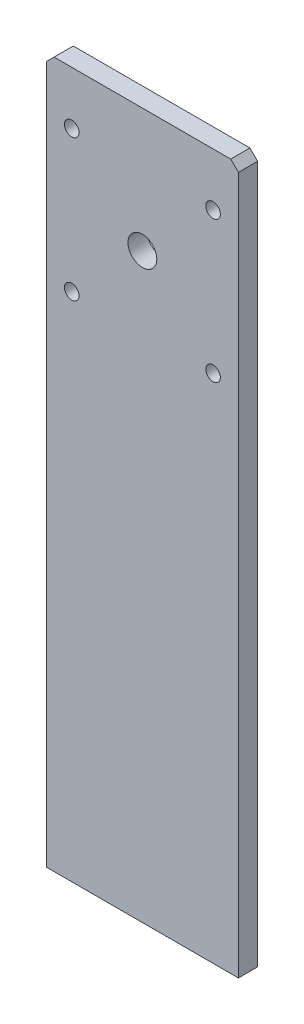
ISO-10303-21;
HEADER;
FILE_DESCRIPTION(('STEP AP214'),'2;1');
FILE_NAME('part.step','',(''),(''),'','','');
FILE_SCHEMA(('AUTOMOTIVE_DESIGN { 1 0 10303 214 1 1 1 1 }'));
ENDSEC;
DATA;
#1=APPLICATION_CONTEXT('core data for automotive mechanical design processes');
#2=APPLICATION_PROTOCOL_DEFINITION('international standard','automotive_design',2000,#1);
#3=PRODUCT_CONTEXT('',#1,'mechanical');
#4=PRODUCT('Part','Part','',(#3));
#5=PRODUCT_RELATED_PRODUCT_CATEGORY('part','',(#4));
#6=PRODUCT_DEFINITION_FORMATION('','',#4);
#7=PRODUCT_DEFINITION_CONTEXT('part definition',#1,'design');
#8=PRODUCT_DEFINITION('design','',#6,#7);
#9=PRODUCT_DEFINITION_SHAPE('','',#8);
#10=(LENGTH_UNIT() NAMED_UNIT(*) SI_UNIT(.MILLI.,.METRE.));
#11=(NAMED_UNIT(*) PLANE_ANGLE_UNIT() SI_UNIT($,.RADIAN.));
#12=(NAMED_UNIT(*) SI_UNIT($,.STERADIAN.) SOLID_ANGLE_UNIT());
#13=UNCERTAINTY_MEASURE_WITH_UNIT(LENGTH_MEASURE(1.E-05),#10,'distance_accuracy_value','');
#14=(GEOMETRIC_REPRESENTATION_CONTEXT(3) GLOBAL_UNCERTAINTY_ASSIGNED_CONTEXT((#13)) GLOBAL_UNIT_ASSIGNED_CONTEXT((#10,
#11,#12)) REPRESENTATION_CONTEXT('',''));
#15=CARTESIAN_POINT('',(0.,0.,0.));
#16=DIRECTION('',(0.,0.,1.));
#17=DIRECTION('',(1.,0.,0.));
#18=AXIS2_PLACEMENT_3D('',#15,#16,#17);
#19=CARTESIAN_POINT('',(0.,0.,6.35));
#20=DIRECTION('',(0.,0.,-1.));
#21=DIRECTION('',(-1.,0.,0.));
#22=AXIS2_PLACEMENT_3D('',#19,#20,#21);
#23=PLANE('',#22);
#24=CARTESIAN_POINT('',(55.118,169.0116,6.35));
#25=DIRECTION('',(0.,0.,1.));
#26=DIRECTION('',(1.,0.,0.));
#27=AXIS2_PLACEMENT_3D('',#24,#25,#26);
#28=CIRCLE('',#27,2.41300000000001);
#29=CARTESIAN_POINT('',(57.531,169.0116,6.35));
#30=VERTEX_POINT('',#29);
#31=EDGE_CURVE('E164',#30,#30,#28,.T.);
#32=ORIENTED_EDGE('',*,*,#31,.F.);
#33=EDGE_LOOP('',(#32));
#34=FACE_BOUND('',#33,.T.);
#35=CARTESIAN_POINT('',(55.118,215.7476,6.35));
#36=DIRECTION('',(0.,0.,1.));
#37=DIRECTION('',(1.,0.,0.));
#38=AXIS2_PLACEMENT_3D('',#35,#36,#37);
#39=CIRCLE('',#38,2.41300000000001);
#40=CARTESIAN_POINT('',(57.531,215.7476,6.35));
#41=VERTEX_POINT('',#40);
#42=EDGE_CURVE('E152',#41,#41,#39,.T.);
#43=ORIENTED_EDGE('',*,*,#42,.F.);
#44=EDGE_LOOP('',(#43));
#45=FACE_BOUND('',#44,.T.);
#46=DIRECTION('',(-1.,0.,0.));
#47=VECTOR('',#46,1.);
#48=CARTESIAN_POINT('',(0.,233.2736,6.35));
#49=LINE('',#48,#47);
#50=CARTESIAN_POINT('',(60.96,233.2736,6.35));
#51=VERTEX_POINT('',#50);
#52=CARTESIAN_POINT('',(2.53999999999996,233.2736,6.35));
#53=VERTEX_POINT('',#52);
#54=EDGE_CURVE('E118',#51,#53,#49,.T.);
#55=ORIENTED_EDGE('',*,*,#54,.T.);
#56=DIRECTION('',(0.707106781186548,0.707106781186548,0.));
#57=VECTOR('',#56,1.);
#58=CARTESIAN_POINT('',(0.,230.7336,6.35));
#59=LINE('',#58,#57);
#60=CARTESIAN_POINT('',(0.,230.7336,6.35));
#61=VERTEX_POINT('',#60);
#62=EDGE_CURVE('E44',#53,#61,#59,.F.);
#63=ORIENTED_EDGE('',*,*,#62,.T.);
#64=DIRECTION('',(0.,-1.,0.));
#65=VECTOR('',#64,1.);
#66=CARTESIAN_POINT('',(0.,0.,6.35));
#67=LINE('',#66,#65);
#68=CARTESIAN_POINT('',(0.,0.,6.35));
#69=VERTEX_POINT('',#68);
#70=EDGE_CURVE('E90',#61,#69,#67,.T.);
#71=ORIENTED_EDGE('',*,*,#70,.T.);
#72=DIRECTION('',(1.,0.,0.));
#73=VECTOR('',#72,1.);
#74=CARTESIAN_POINT('',(0.,0.,6.35));
#75=LINE('',#74,#73);
#76=CARTESIAN_POINT('',(63.5,0.,6.35));
#77=VERTEX_POINT('',#76);
#78=EDGE_CURVE('E93',#69,#77,#75,.T.);
#79=ORIENTED_EDGE('',*,*,#78,.T.);
#80=DIRECTION('',(0.,1.,0.));
#81=VECTOR('',#80,1.);
#82=CARTESIAN_POINT('',(63.5,0.,6.35));
#83=LINE('',#82,#81);
#84=CARTESIAN_POINT('',(63.5,230.7336,6.35));
#85=VERTEX_POINT('',#84);
#86=EDGE_CURVE('E108',#77,#85,#83,.T.);
#87=ORIENTED_EDGE('',*,*,#86,.T.);
#88=DIRECTION('',(0.707106781186544,-0.707106781186551,0.));
#89=VECTOR('',#88,1.);
#90=CARTESIAN_POINT('',(60.96,233.2736,6.35));
#91=LINE('',#90,#89);
#92=EDGE_CURVE('E129',#85,#51,#91,.F.);
#93=ORIENTED_EDGE('',*,*,#92,.T.);
#94=EDGE_LOOP('',(#55,#63,#71,#79,#87,#93));
#95=FACE_BOUND('',#94,.T.);
#96=CARTESIAN_POINT('',(8.38199999999999,215.7476,6.35));
#97=DIRECTION('',(0.,0.,1.));
#98=DIRECTION('',(1.,0.,0.));
#99=AXIS2_PLACEMENT_3D('',#96,#97,#98);
#100=CIRCLE('',#99,2.41300000000003);
#101=CARTESIAN_POINT('',(10.795,215.7476,6.35));
#102=VERTEX_POINT('',#101);
#103=EDGE_CURVE('E146',#102,#102,#100,.T.);
#104=ORIENTED_EDGE('',*,*,#103,.F.);
#105=EDGE_LOOP('',(#104));
#106=FACE_BOUND('',#105,.T.);
#107=CARTESIAN_POINT('',(8.38199999999999,169.0116,6.35));
#108=DIRECTION('',(0.,0.,1.));
#109=DIRECTION('',(1.,0.,0.));
#110=AXIS2_PLACEMENT_3D('',#107,#108,#109);
#111=CIRCLE('',#110,2.41300000000003);
#112=CARTESIAN_POINT('',(10.795,169.0116,6.35));
#113=VERTEX_POINT('',#112);
#114=EDGE_CURVE('E158',#113,#113,#111,.T.);
#115=ORIENTED_EDGE('',*,*,#114,.F.);
#116=EDGE_LOOP('',(#115));
#117=FACE_BOUND('',#116,.T.);
#118=CARTESIAN_POINT('',(31.75,192.3796,6.35));
#119=DIRECTION('',(0.,0.,1.));
#120=DIRECTION('',(1.,0.,0.));
#121=AXIS2_PLACEMENT_3D('',#118,#119,#120);
#122=CIRCLE('',#121,4.7625);
#123=CARTESIAN_POINT('',(36.5125,192.3796,6.35));
#124=VERTEX_POINT('',#123);
#125=EDGE_CURVE('E170',#124,#124,#122,.T.);
#126=ORIENTED_EDGE('',*,*,#125,.F.);
#127=EDGE_LOOP('',(#126));
#128=FACE_BOUND('',#127,.T.);
#129=ADVANCED_FACE('F36',(#34,#45,#95,#106,#117,#128),#23,.F.);
#130=CARTESIAN_POINT('',(0.,0.,0.));
#131=DIRECTION('',(0.,0.,-1.));
#132=DIRECTION('',(-1.,0.,0.));
#133=AXIS2_PLACEMENT_3D('',#130,#131,#132);
#134=PLANE('',#133);
#135=CARTESIAN_POINT('',(55.118,169.0116,0.));
#136=DIRECTION('',(0.,0.,1.));
#137=DIRECTION('',(1.,0.,0.));
#138=AXIS2_PLACEMENT_3D('',#135,#136,#137);
#139=CIRCLE('',#138,2.41300000000001);
#140=CARTESIAN_POINT('',(57.531,169.0116,0.));
#141=VERTEX_POINT('',#140);
#142=EDGE_CURVE('E167',#141,#141,#139,.T.);
#143=ORIENTED_EDGE('',*,*,#142,.T.);
#144=EDGE_LOOP('',(#143));
#145=FACE_BOUND('',#144,.T.);
#146=CARTESIAN_POINT('',(55.118,215.7476,0.));
#147=DIRECTION('',(0.,0.,1.));
#148=DIRECTION('',(1.,0.,0.));
#149=AXIS2_PLACEMENT_3D('',#146,#147,#148);
#150=CIRCLE('',#149,2.41300000000001);
#151=CARTESIAN_POINT('',(57.531,215.7476,0.));
#152=VERTEX_POINT('',#151);
#153=EDGE_CURVE('E155',#152,#152,#150,.T.);
#154=ORIENTED_EDGE('',*,*,#153,.T.);
#155=EDGE_LOOP('',(#154));
#156=FACE_BOUND('',#155,.T.);
#157=DIRECTION('',(0.,-1.,0.));
#158=VECTOR('',#157,1.);
#159=CARTESIAN_POINT('',(0.,0.,0.));
#160=LINE('',#159,#158);
#161=CARTESIAN_POINT('',(0.,230.7336,0.));
#162=VERTEX_POINT('',#161);
#163=CARTESIAN_POINT('',(0.,0.,0.));
#164=VERTEX_POINT('',#163);
#165=EDGE_CURVE('E112',#162,#164,#160,.T.);
#166=ORIENTED_EDGE('',*,*,#165,.F.);
#167=DIRECTION('',(-0.707106781186548,-0.707106781186548,0.));
#168=VECTOR('',#167,1.);
#169=CARTESIAN_POINT('',(-115.3668,115.3668,0.));
#170=LINE('',#169,#168);
#171=CARTESIAN_POINT('',(2.53999999999996,233.2736,0.));
#172=VERTEX_POINT('',#171);
#173=EDGE_CURVE('E123',#162,#172,#170,.F.);
#174=ORIENTED_EDGE('',*,*,#173,.T.);
#175=DIRECTION('',(-1.,0.,0.));
#176=VECTOR('',#175,1.);
#177=CARTESIAN_POINT('',(0.,233.2736,0.));
#178=LINE('',#177,#176);
#179=CARTESIAN_POINT('',(60.9599999999999,233.2736,0.));
#180=VERTEX_POINT('',#179);
#181=EDGE_CURVE('E100',#180,#172,#178,.T.);
#182=ORIENTED_EDGE('',*,*,#181,.F.);
#183=DIRECTION('',(-0.707106781186544,0.707106781186551,0.));
#184=VECTOR('',#183,1.);
#185=CARTESIAN_POINT('',(147.1168,147.116799999999,0.));
#186=LINE('',#185,#184);
#187=CARTESIAN_POINT('',(63.5,230.7336,0.));
#188=VERTEX_POINT('',#187);
#189=EDGE_CURVE('E116',#180,#188,#186,.F.);
#190=ORIENTED_EDGE('',*,*,#189,.T.);
#191=DIRECTION('',(0.,1.,0.));
#192=VECTOR('',#191,1.);
#193=CARTESIAN_POINT('',(63.5,0.,0.));
#194=LINE('',#193,#192);
#195=CARTESIAN_POINT('',(63.5,0.,0.));
#196=VERTEX_POINT('',#195);
#197=EDGE_CURVE('E140',#196,#188,#194,.T.);
#198=ORIENTED_EDGE('',*,*,#197,.F.);
#199=DIRECTION('',(1.,0.,0.));
#200=VECTOR('',#199,1.);
#201=CARTESIAN_POINT('',(0.,0.,0.));
#202=LINE('',#201,#200);
#203=EDGE_CURVE('E142',#164,#196,#202,.T.);
#204=ORIENTED_EDGE('',*,*,#203,.F.);
#205=EDGE_LOOP('',(#166,#174,#182,#190,#198,#204));
#206=FACE_BOUND('',#205,.T.);
#207=CARTESIAN_POINT('',(8.38199999999999,215.7476,0.));
#208=DIRECTION('',(0.,0.,1.));
#209=DIRECTION('',(1.,0.,0.));
#210=AXIS2_PLACEMENT_3D('',#207,#208,#209);
#211=CIRCLE('',#210,2.41300000000003);
#212=CARTESIAN_POINT('',(10.795,215.7476,0.));
#213=VERTEX_POINT('',#212);
#214=EDGE_CURVE('E149',#213,#213,#211,.T.);
#215=ORIENTED_EDGE('',*,*,#214,.T.);
#216=EDGE_LOOP('',(#215));
#217=FACE_BOUND('',#216,.T.);
#218=CARTESIAN_POINT('',(8.38199999999999,169.0116,0.));
#219=DIRECTION('',(0.,0.,1.));
#220=DIRECTION('',(1.,0.,0.));
#221=AXIS2_PLACEMENT_3D('',#218,#219,#220);
#222=CIRCLE('',#221,2.41300000000003);
#223=CARTESIAN_POINT('',(10.795,169.0116,0.));
#224=VERTEX_POINT('',#223);
#225=EDGE_CURVE('E161',#224,#224,#222,.T.);
#226=ORIENTED_EDGE('',*,*,#225,.T.);
#227=EDGE_LOOP('',(#226));
#228=FACE_BOUND('',#227,.T.);
#229=CARTESIAN_POINT('',(31.75,192.3796,0.));
#230=DIRECTION('',(0.,0.,1.));
#231=DIRECTION('',(1.,0.,0.));
#232=AXIS2_PLACEMENT_3D('',#229,#230,#231);
#233=CIRCLE('',#232,4.7625);
#234=CARTESIAN_POINT('',(36.5125,192.3796,0.));
#235=VERTEX_POINT('',#234);
#236=EDGE_CURVE('E173',#235,#235,#233,.T.);
#237=ORIENTED_EDGE('',*,*,#236,.T.);
#238=EDGE_LOOP('',(#237));
#239=FACE_BOUND('',#238,.T.);
#240=ADVANCED_FACE('F138',(#145,#156,#206,#217,#228,#239),#134,.T.);
#241=CARTESIAN_POINT('',(0.,0.,6.35));
#242=DIRECTION('',(1.,0.,0.));
#243=DIRECTION('',(0.,0.,-1.));
#244=AXIS2_PLACEMENT_3D('',#241,#242,#243);
#245=PLANE('',#244);
#246=ORIENTED_EDGE('',*,*,#70,.F.);
#247=DIRECTION('',(0.,0.,-1.));
#248=VECTOR('',#247,1.);
#249=CARTESIAN_POINT('',(0.,230.7336,6.35));
#250=LINE('',#249,#248);
#251=EDGE_CURVE('E114',#61,#162,#250,.T.);
#252=ORIENTED_EDGE('',*,*,#251,.T.);
#253=ORIENTED_EDGE('',*,*,#165,.T.);
#254=DIRECTION('',(0.,0.,-1.));
#255=VECTOR('',#254,1.);
#256=CARTESIAN_POINT('',(0.,0.,6.35));
#257=LINE('',#256,#255);
#258=EDGE_CURVE('E105',#69,#164,#257,.T.);
#259=ORIENTED_EDGE('',*,*,#258,.F.);
#260=EDGE_LOOP('',(#246,#252,#253,#259));
#261=FACE_BOUND('',#260,.T.);
#262=ADVANCED_FACE('F110',(#261),#245,.F.);
#263=CARTESIAN_POINT('',(0.,0.,6.35));
#264=DIRECTION('',(0.,1.,0.));
#265=DIRECTION('',(0.,0.,1.));
#266=AXIS2_PLACEMENT_3D('',#263,#264,#265);
#267=PLANE('',#266);
#268=ORIENTED_EDGE('',*,*,#203,.T.);
#269=DIRECTION('',(0.,0.,-1.));
#270=VECTOR('',#269,1.);
#271=CARTESIAN_POINT('',(63.5,0.,6.35));
#272=LINE('',#271,#270);
#273=EDGE_CURVE('E107',#77,#196,#272,.T.);
#274=ORIENTED_EDGE('',*,*,#273,.F.);
#275=ORIENTED_EDGE('',*,*,#78,.F.);
#276=ORIENTED_EDGE('',*,*,#258,.T.);
#277=EDGE_LOOP('',(#268,#274,#275,#276));
#278=FACE_BOUND('',#277,.T.);
#279=ADVANCED_FACE('F104',(#278),#267,.F.);
#280=CARTESIAN_POINT('',(63.5,0.,6.35));
#281=DIRECTION('',(-1.,0.,0.));
#282=DIRECTION('',(0.,0.,1.));
#283=AXIS2_PLACEMENT_3D('',#280,#281,#282);
#284=PLANE('',#283);
#285=ORIENTED_EDGE('',*,*,#197,.T.);
#286=DIRECTION('',(0.,0.,1.));
#287=VECTOR('',#286,1.);
#288=CARTESIAN_POINT('',(63.5,230.7336,6.35));
#289=LINE('',#288,#287);
#290=EDGE_CURVE('E11',#188,#85,#289,.T.);
#291=ORIENTED_EDGE('',*,*,#290,.T.);
#292=ORIENTED_EDGE('',*,*,#86,.F.);
#293=ORIENTED_EDGE('',*,*,#273,.T.);
#294=EDGE_LOOP('',(#285,#291,#292,#293));
#295=FACE_BOUND('',#294,.T.);
#296=ADVANCED_FACE('F141',(#295),#284,.F.);
#297=CARTESIAN_POINT('',(0.,233.2736,6.35));
#298=DIRECTION('',(0.,-1.,0.));
#299=DIRECTION('',(0.,0.,-1.));
#300=AXIS2_PLACEMENT_3D('',#297,#298,#299);
#301=PLANE('',#300);
#302=ORIENTED_EDGE('',*,*,#181,.T.);
#303=DIRECTION('',(0.,0.,1.));
#304=VECTOR('',#303,1.);
#305=CARTESIAN_POINT('',(2.53999999999996,233.2736,6.35));
#306=LINE('',#305,#304);
#307=EDGE_CURVE('E57',#172,#53,#306,.T.);
#308=ORIENTED_EDGE('',*,*,#307,.T.);
#309=ORIENTED_EDGE('',*,*,#54,.F.);
#310=DIRECTION('',(0.,0.,-1.));
#311=VECTOR('',#310,1.);
#312=CARTESIAN_POINT('',(60.96,233.2736,6.35));
#313=LINE('',#312,#311);
#314=EDGE_CURVE('E125',#51,#180,#313,.T.);
#315=ORIENTED_EDGE('',*,*,#314,.T.);
#316=EDGE_LOOP('',(#302,#308,#309,#315));
#317=FACE_BOUND('',#316,.T.);
#318=ADVANCED_FACE('F133',(#317),#301,.F.);
#319=CARTESIAN_POINT('',(8.38199999999999,215.7476,6.35));
#320=DIRECTION('',(0.,0.,-1.));
#321=DIRECTION('',(-1.,0.,0.));
#322=AXIS2_PLACEMENT_3D('',#319,#320,#321);
#323=CYLINDRICAL_SURFACE('',#322,2.41300000000003);
#324=ORIENTED_EDGE('',*,*,#103,.T.);
#325=EDGE_LOOP('',(#324));
#326=FACE_BOUND('',#325,.T.);
#327=ORIENTED_EDGE('',*,*,#214,.F.);
#328=EDGE_LOOP('',(#327));
#329=FACE_BOUND('',#328,.T.);
#330=ADVANCED_FACE('F193',(#326,#329),#323,.F.);
#331=CARTESIAN_POINT('',(55.118,215.7476,6.35));
#332=DIRECTION('',(0.,0.,-1.));
#333=DIRECTION('',(-1.,0.,0.));
#334=AXIS2_PLACEMENT_3D('',#331,#332,#333);
#335=CYLINDRICAL_SURFACE('',#334,2.41300000000001);
#336=ORIENTED_EDGE('',*,*,#42,.T.);
#337=EDGE_LOOP('',(#336));
#338=FACE_BOUND('',#337,.T.);
#339=ORIENTED_EDGE('',*,*,#153,.F.);
#340=EDGE_LOOP('',(#339));
#341=FACE_BOUND('',#340,.T.);
#342=ADVANCED_FACE('F220',(#338,#341),#335,.F.);
#343=CARTESIAN_POINT('',(8.38199999999999,169.0116,6.35));
#344=DIRECTION('',(0.,0.,-1.));
#345=DIRECTION('',(-1.,0.,0.));
#346=AXIS2_PLACEMENT_3D('',#343,#344,#345);
#347=CYLINDRICAL_SURFACE('',#346,2.41300000000003);
#348=ORIENTED_EDGE('',*,*,#114,.T.);
#349=EDGE_LOOP('',(#348));
#350=FACE_BOUND('',#349,.T.);
#351=ORIENTED_EDGE('',*,*,#225,.F.);
#352=EDGE_LOOP('',(#351));
#353=FACE_BOUND('',#352,.T.);
#354=ADVANCED_FACE('F215',(#350,#353),#347,.F.);
#355=CARTESIAN_POINT('',(55.118,169.0116,6.35));
#356=DIRECTION('',(0.,0.,-1.));
#357=DIRECTION('',(-1.,0.,0.));
#358=AXIS2_PLACEMENT_3D('',#355,#356,#357);
#359=CYLINDRICAL_SURFACE('',#358,2.41300000000001);
#360=ORIENTED_EDGE('',*,*,#31,.T.);
#361=EDGE_LOOP('',(#360));
#362=FACE_BOUND('',#361,.T.);
#363=ORIENTED_EDGE('',*,*,#142,.F.);
#364=EDGE_LOOP('',(#363));
#365=FACE_BOUND('',#364,.T.);
#366=ADVANCED_FACE('F210',(#362,#365),#359,.F.);
#367=CARTESIAN_POINT('',(31.75,192.3796,6.35));
#368=DIRECTION('',(0.,0.,-1.));
#369=DIRECTION('',(-1.,0.,0.));
#370=AXIS2_PLACEMENT_3D('',#367,#368,#369);
#371=CYLINDRICAL_SURFACE('',#370,4.7625);
#372=ORIENTED_EDGE('',*,*,#125,.T.);
#373=EDGE_LOOP('',(#372));
#374=FACE_BOUND('',#373,.T.);
#375=ORIENTED_EDGE('',*,*,#236,.F.);
#376=EDGE_LOOP('',(#375));
#377=FACE_BOUND('',#376,.T.);
#378=ADVANCED_FACE('F179',(#374,#377),#371,.F.);
#379=CARTESIAN_POINT('',(0.,230.7336,6.35));
#380=DIRECTION('',(0.707106781186547,-0.707106781186547,0.));
#381=DIRECTION('',(0.,0.,-1.));
#382=AXIS2_PLACEMENT_3D('',#379,#380,#381);
#383=PLANE('',#382);
#384=ORIENTED_EDGE('',*,*,#62,.F.);
#385=ORIENTED_EDGE('',*,*,#307,.F.);
#386=ORIENTED_EDGE('',*,*,#173,.F.);
#387=ORIENTED_EDGE('',*,*,#251,.F.);
#388=EDGE_LOOP('',(#384,#385,#386,#387));
#389=FACE_BOUND('',#388,.T.);
#390=ADVANCED_FACE('F203',(#389),#383,.F.);
#391=CARTESIAN_POINT('',(60.96,233.2736,6.35));
#392=DIRECTION('',(-0.707106781186551,-0.707106781186544,0.));
#393=DIRECTION('',(0.,0.,-1.));
#394=AXIS2_PLACEMENT_3D('',#391,#392,#393);
#395=PLANE('',#394);
#396=ORIENTED_EDGE('',*,*,#92,.F.);
#397=ORIENTED_EDGE('',*,*,#290,.F.);
#398=ORIENTED_EDGE('',*,*,#189,.F.);
#399=ORIENTED_EDGE('',*,*,#314,.F.);
#400=EDGE_LOOP('',(#396,#397,#398,#399));
#401=FACE_BOUND('',#400,.T.);
#402=ADVANCED_FACE('F38',(#401),#395,.F.);
#403=CLOSED_SHELL('',(#129,#240,#262,#279,#296,#318,#330,#342,#354,#366,#378,#390,#402));
#404=MANIFOLD_SOLID_BREP('B2',#403);
#405=ADVANCED_BREP_SHAPE_REPRESENTATION('',(#18,#404),#14);
#406=SHAPE_DEFINITION_REPRESENTATION(#9,#405);
ENDSEC;
END-ISO-10303-21;
